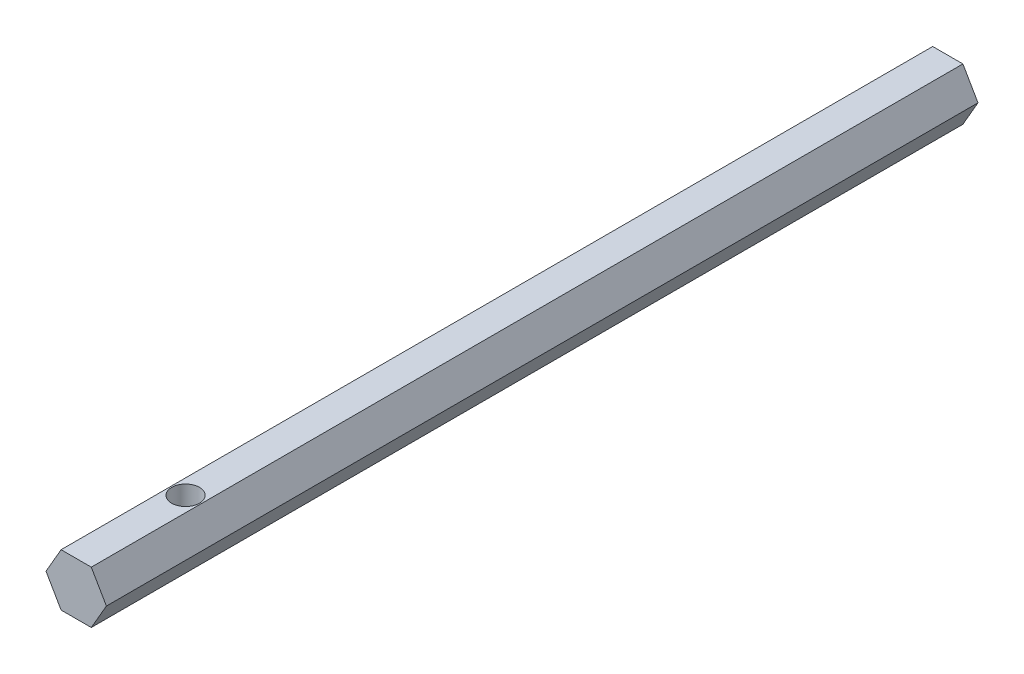
ISO-10303-21;
HEADER;
FILE_DESCRIPTION(('STEP AP214'),'2;1');
FILE_NAME('part.step','',(''),(''),'','','');
FILE_SCHEMA(('AUTOMOTIVE_DESIGN { 1 0 10303 214 1 1 1 1 }'));
ENDSEC;
DATA;
#1=APPLICATION_CONTEXT('core data for automotive mechanical design processes');
#2=APPLICATION_PROTOCOL_DEFINITION('international standard','automotive_design',2000,#1);
#3=PRODUCT_CONTEXT('',#1,'mechanical');
#4=PRODUCT('Part','Part','',(#3));
#5=PRODUCT_RELATED_PRODUCT_CATEGORY('part','',(#4));
#6=PRODUCT_DEFINITION_FORMATION('','',#4);
#7=PRODUCT_DEFINITION_CONTEXT('part definition',#1,'design');
#8=PRODUCT_DEFINITION('design','',#6,#7);
#9=PRODUCT_DEFINITION_SHAPE('','',#8);
#10=(LENGTH_UNIT() NAMED_UNIT(*) SI_UNIT(.MILLI.,.METRE.));
#11=(NAMED_UNIT(*) PLANE_ANGLE_UNIT() SI_UNIT($,.RADIAN.));
#12=(NAMED_UNIT(*) SI_UNIT($,.STERADIAN.) SOLID_ANGLE_UNIT());
#13=UNCERTAINTY_MEASURE_WITH_UNIT(LENGTH_MEASURE(1.E-05),#10,'distance_accuracy_value','');
#14=(GEOMETRIC_REPRESENTATION_CONTEXT(3) GLOBAL_UNCERTAINTY_ASSIGNED_CONTEXT((#13)) GLOBAL_UNIT_ASSIGNED_CONTEXT((#10,
#11,#12)) REPRESENTATION_CONTEXT('',''));
#15=CARTESIAN_POINT('',(0.,0.,0.));
#16=DIRECTION('',(0.,0.,1.));
#17=DIRECTION('',(1.,0.,0.));
#18=AXIS2_PLACEMENT_3D('',#15,#16,#17);
#19=CARTESIAN_POINT('',(0.866025403784438,-1.5,50.));
#20=DIRECTION('',(-0.866025403784439,0.5,0.));
#21=DIRECTION('',(-0.5,-0.866025403784439,0.));
#22=AXIS2_PLACEMENT_3D('',#19,#20,#21);
#23=PLANE('',#22);
#24=DIRECTION('',(0.5,0.866025403784439,0.));
#25=VECTOR('',#24,1.);
#26=CARTESIAN_POINT('',(0.866025403784438,-1.5,0.));
#27=LINE('',#26,#25);
#28=CARTESIAN_POINT('',(0.866025403784438,-1.5,0.));
#29=VERTEX_POINT('',#28);
#30=CARTESIAN_POINT('',(1.73205080756888,0.,0.));
#31=VERTEX_POINT('',#30);
#32=EDGE_CURVE('E125',#29,#31,#27,.T.);
#33=ORIENTED_EDGE('',*,*,#32,.T.);
#34=DIRECTION('',(0.,0.,-1.));
#35=VECTOR('',#34,1.);
#36=CARTESIAN_POINT('',(1.73205080756888,0.,50.));
#37=LINE('',#36,#35);
#38=CARTESIAN_POINT('',(1.73205080756888,0.,50.));
#39=VERTEX_POINT('',#38);
#40=EDGE_CURVE('E11',#39,#31,#37,.T.);
#41=ORIENTED_EDGE('',*,*,#40,.F.);
#42=DIRECTION('',(0.5,0.866025403784439,0.));
#43=VECTOR('',#42,1.);
#44=CARTESIAN_POINT('',(0.866025403784438,-1.5,50.));
#45=LINE('',#44,#43);
#46=CARTESIAN_POINT('',(0.866025403784438,-1.5,50.));
#47=VERTEX_POINT('',#46);
#48=EDGE_CURVE('E136',#47,#39,#45,.T.);
#49=ORIENTED_EDGE('',*,*,#48,.F.);
#50=DIRECTION('',(0.,0.,-1.));
#51=VECTOR('',#50,1.);
#52=CARTESIAN_POINT('',(0.866025403784438,-1.5,50.));
#53=LINE('',#52,#51);
#54=EDGE_CURVE('E121',#47,#29,#53,.T.);
#55=ORIENTED_EDGE('',*,*,#54,.T.);
#56=EDGE_LOOP('',(#33,#41,#49,#55));
#57=FACE_BOUND('',#56,.T.);
#58=ADVANCED_FACE('F41',(#57),#23,.F.);
#59=CARTESIAN_POINT('',(1.73205080756888,0.,50.));
#60=DIRECTION('',(-0.866025403784439,-0.5,0.));
#61=DIRECTION('',(0.5,-0.866025403784439,0.));
#62=AXIS2_PLACEMENT_3D('',#59,#60,#61);
#63=PLANE('',#62);
#64=DIRECTION('',(-0.5,0.866025403784439,0.));
#65=VECTOR('',#64,1.);
#66=CARTESIAN_POINT('',(1.73205080756888,0.,0.));
#67=LINE('',#66,#65);
#68=CARTESIAN_POINT('',(0.866025403784439,1.5,0.));
#69=VERTEX_POINT('',#68);
#70=EDGE_CURVE('E128',#31,#69,#67,.T.);
#71=ORIENTED_EDGE('',*,*,#70,.T.);
#72=DIRECTION('',(0.,0.,-1.));
#73=VECTOR('',#72,1.);
#74=CARTESIAN_POINT('',(0.866025403784439,1.5,50.));
#75=LINE('',#74,#73);
#76=CARTESIAN_POINT('',(0.866025403784439,1.5,50.));
#77=VERTEX_POINT('',#76);
#78=EDGE_CURVE('E49',#77,#69,#75,.T.);
#79=ORIENTED_EDGE('',*,*,#78,.F.);
#80=DIRECTION('',(-0.5,0.866025403784439,0.));
#81=VECTOR('',#80,1.);
#82=CARTESIAN_POINT('',(1.73205080756888,0.,50.));
#83=LINE('',#82,#81);
#84=EDGE_CURVE('E94',#39,#77,#83,.T.);
#85=ORIENTED_EDGE('',*,*,#84,.F.);
#86=ORIENTED_EDGE('',*,*,#40,.T.);
#87=EDGE_LOOP('',(#71,#79,#85,#86));
#88=FACE_BOUND('',#87,.T.);
#89=ADVANCED_FACE('F164',(#88),#63,.F.);
#90=CARTESIAN_POINT('',(0.866025403784439,1.5,50.));
#91=DIRECTION('',(0.,-1.,0.));
#92=DIRECTION('',(1.,0.,0.));
#93=AXIS2_PLACEMENT_3D('',#90,#91,#92);
#94=PLANE('',#93);
#95=CARTESIAN_POINT('',(-1.72008754483228E-13,1.5,43.7261999999998));
#96=DIRECTION('',(0.,1.,0.));
#97=DIRECTION('',(0.,0.,1.));
#98=AXIS2_PLACEMENT_3D('',#95,#96,#97);
#99=CIRCLE('',#98,0.793749999999987);
#100=CARTESIAN_POINT('',(-1.72008754483228E-13,1.5,44.5199499999998));
#101=VERTEX_POINT('',#100);
#102=EDGE_CURVE('E230',#101,#101,#99,.T.);
#103=ORIENTED_EDGE('',*,*,#102,.F.);
#104=EDGE_LOOP('',(#103));
#105=FACE_BOUND('',#104,.T.);
#106=DIRECTION('',(-1.,0.,0.));
#107=VECTOR('',#106,1.);
#108=CARTESIAN_POINT('',(0.866025403784439,1.5,0.));
#109=LINE('',#108,#107);
#110=CARTESIAN_POINT('',(-0.866025403784439,1.5,0.));
#111=VERTEX_POINT('',#110);
#112=EDGE_CURVE('E131',#69,#111,#109,.T.);
#113=ORIENTED_EDGE('',*,*,#112,.T.);
#114=DIRECTION('',(0.,0.,-1.));
#115=VECTOR('',#114,1.);
#116=CARTESIAN_POINT('',(-0.866025403784439,1.5,50.));
#117=LINE('',#116,#115);
#118=CARTESIAN_POINT('',(-0.866025403784439,1.5,50.));
#119=VERTEX_POINT('',#118);
#120=EDGE_CURVE('E116',#119,#111,#117,.T.);
#121=ORIENTED_EDGE('',*,*,#120,.F.);
#122=DIRECTION('',(-1.,0.,0.));
#123=VECTOR('',#122,1.);
#124=CARTESIAN_POINT('',(0.866025403784439,1.5,50.));
#125=LINE('',#124,#123);
#126=EDGE_CURVE('E107',#77,#119,#125,.T.);
#127=ORIENTED_EDGE('',*,*,#126,.F.);
#128=ORIENTED_EDGE('',*,*,#78,.T.);
#129=EDGE_LOOP('',(#113,#121,#127,#128));
#130=FACE_BOUND('',#129,.T.);
#131=ADVANCED_FACE('F142',(#105,#130),#94,.F.);
#132=CARTESIAN_POINT('',(-0.866025403784439,1.5,50.));
#133=DIRECTION('',(0.866025403784439,-0.5,0.));
#134=DIRECTION('',(0.5,0.866025403784439,0.));
#135=AXIS2_PLACEMENT_3D('',#132,#133,#134);
#136=PLANE('',#135);
#137=DIRECTION('',(-0.5,-0.866025403784439,0.));
#138=VECTOR('',#137,1.);
#139=CARTESIAN_POINT('',(-0.866025403784439,1.5,0.));
#140=LINE('',#139,#138);
#141=CARTESIAN_POINT('',(-1.73205080756888,0.,0.));
#142=VERTEX_POINT('',#141);
#143=EDGE_CURVE('E115',#111,#142,#140,.T.);
#144=ORIENTED_EDGE('',*,*,#143,.T.);
#145=DIRECTION('',(0.,0.,-1.));
#146=VECTOR('',#145,1.);
#147=CARTESIAN_POINT('',(-1.73205080756888,0.,50.));
#148=LINE('',#147,#146);
#149=CARTESIAN_POINT('',(-1.73205080756888,0.,50.));
#150=VERTEX_POINT('',#149);
#151=EDGE_CURVE('E112',#150,#142,#148,.T.);
#152=ORIENTED_EDGE('',*,*,#151,.F.);
#153=DIRECTION('',(-0.5,-0.866025403784439,0.));
#154=VECTOR('',#153,1.);
#155=CARTESIAN_POINT('',(-0.866025403784439,1.5,50.));
#156=LINE('',#155,#154);
#157=EDGE_CURVE('E101',#119,#150,#156,.T.);
#158=ORIENTED_EDGE('',*,*,#157,.F.);
#159=ORIENTED_EDGE('',*,*,#120,.T.);
#160=EDGE_LOOP('',(#144,#152,#158,#159));
#161=FACE_BOUND('',#160,.T.);
#162=ADVANCED_FACE('F113',(#161),#136,.F.);
#163=CARTESIAN_POINT('',(-1.73205080756888,0.,50.));
#164=DIRECTION('',(0.866025403784439,0.5,0.));
#165=DIRECTION('',(-0.5,0.866025403784439,0.));
#166=AXIS2_PLACEMENT_3D('',#163,#164,#165);
#167=PLANE('',#166);
#168=DIRECTION('',(0.5,-0.866025403784439,0.));
#169=VECTOR('',#168,1.);
#170=CARTESIAN_POINT('',(-1.73205080756888,0.,0.));
#171=LINE('',#170,#169);
#172=CARTESIAN_POINT('',(-0.866025403784439,-1.5,0.));
#173=VERTEX_POINT('',#172);
#174=EDGE_CURVE('E80',#142,#173,#171,.T.);
#175=ORIENTED_EDGE('',*,*,#174,.T.);
#176=DIRECTION('',(0.,0.,-1.));
#177=VECTOR('',#176,1.);
#178=CARTESIAN_POINT('',(-0.866025403784439,-1.5,50.));
#179=LINE('',#178,#177);
#180=CARTESIAN_POINT('',(-0.866025403784439,-1.5,50.));
#181=VERTEX_POINT('',#180);
#182=EDGE_CURVE('E117',#181,#173,#179,.T.);
#183=ORIENTED_EDGE('',*,*,#182,.F.);
#184=DIRECTION('',(0.5,-0.866025403784439,0.));
#185=VECTOR('',#184,1.);
#186=CARTESIAN_POINT('',(-1.73205080756888,0.,50.));
#187=LINE('',#186,#185);
#188=EDGE_CURVE('E105',#150,#181,#187,.T.);
#189=ORIENTED_EDGE('',*,*,#188,.F.);
#190=ORIENTED_EDGE('',*,*,#151,.T.);
#191=EDGE_LOOP('',(#175,#183,#189,#190));
#192=FACE_BOUND('',#191,.T.);
#193=ADVANCED_FACE('F119',(#192),#167,.F.);
#194=CARTESIAN_POINT('',(-0.866025403784439,-1.5,50.));
#195=DIRECTION('',(0.,1.,0.));
#196=DIRECTION('',(0.,0.,1.));
#197=AXIS2_PLACEMENT_3D('',#194,#195,#196);
#198=PLANE('',#197);
#199=CARTESIAN_POINT('',(-1.72008754483228E-13,-1.5,43.7261999999998));
#200=DIRECTION('',(0.,1.,0.));
#201=DIRECTION('',(0.,0.,1.));
#202=AXIS2_PLACEMENT_3D('',#199,#200,#201);
#203=CIRCLE('',#202,0.793749999999999);
#204=CARTESIAN_POINT('',(-1.72008754483228E-13,-1.5,44.5199499999998));
#205=VERTEX_POINT('',#204);
#206=EDGE_CURVE('E129',#205,#205,#203,.T.);
#207=ORIENTED_EDGE('',*,*,#206,.T.);
#208=EDGE_LOOP('',(#207));
#209=FACE_BOUND('',#208,.T.);
#210=DIRECTION('',(1.,0.,0.));
#211=VECTOR('',#210,1.);
#212=CARTESIAN_POINT('',(-0.866025403784439,-1.5,0.));
#213=LINE('',#212,#211);
#214=EDGE_CURVE('E86',#173,#29,#213,.T.);
#215=ORIENTED_EDGE('',*,*,#214,.T.);
#216=ORIENTED_EDGE('',*,*,#54,.F.);
#217=DIRECTION('',(1.,0.,0.));
#218=VECTOR('',#217,1.);
#219=CARTESIAN_POINT('',(-0.866025403784439,-1.5,50.));
#220=LINE('',#219,#218);
#221=EDGE_CURVE('E57',#181,#47,#220,.T.);
#222=ORIENTED_EDGE('',*,*,#221,.F.);
#223=ORIENTED_EDGE('',*,*,#182,.T.);
#224=EDGE_LOOP('',(#215,#216,#222,#223));
#225=FACE_BOUND('',#224,.T.);
#226=ADVANCED_FACE('F149',(#209,#225),#198,.F.);
#227=CARTESIAN_POINT('',(0.,0.,50.));
#228=DIRECTION('',(0.,0.,1.));
#229=DIRECTION('',(1.,0.,0.));
#230=AXIS2_PLACEMENT_3D('',#227,#228,#229);
#231=PLANE('',#230);
#232=ORIENTED_EDGE('',*,*,#48,.T.);
#233=ORIENTED_EDGE('',*,*,#84,.T.);
#234=ORIENTED_EDGE('',*,*,#126,.T.);
#235=ORIENTED_EDGE('',*,*,#157,.T.);
#236=ORIENTED_EDGE('',*,*,#188,.T.);
#237=ORIENTED_EDGE('',*,*,#221,.T.);
#238=EDGE_LOOP('',(#232,#233,#234,#235,#236,#237));
#239=FACE_BOUND('',#238,.T.);
#240=ADVANCED_FACE('F103',(#239),#231,.T.);
#241=CARTESIAN_POINT('',(0.,0.,0.));
#242=DIRECTION('',(0.,0.,1.));
#243=DIRECTION('',(1.,0.,0.));
#244=AXIS2_PLACEMENT_3D('',#241,#242,#243);
#245=PLANE('',#244);
#246=ORIENTED_EDGE('',*,*,#32,.F.);
#247=ORIENTED_EDGE('',*,*,#214,.F.);
#248=ORIENTED_EDGE('',*,*,#174,.F.);
#249=ORIENTED_EDGE('',*,*,#143,.F.);
#250=ORIENTED_EDGE('',*,*,#112,.F.);
#251=ORIENTED_EDGE('',*,*,#70,.F.);
#252=EDGE_LOOP('',(#246,#247,#248,#249,#250,#251));
#253=FACE_BOUND('',#252,.T.);
#254=ADVANCED_FACE('F145',(#253),#245,.F.);
#255=CARTESIAN_POINT('',(-1.72008754483228E-13,1.5,43.7261999999998));
#256=DIRECTION('',(0.,1.,0.));
#257=DIRECTION('',(0.,0.,1.));
#258=AXIS2_PLACEMENT_3D('',#255,#256,#257);
#259=CYLINDRICAL_SURFACE('',#258,0.793749999999993);
#260=ORIENTED_EDGE('',*,*,#206,.F.);
#261=EDGE_LOOP('',(#260));
#262=FACE_BOUND('',#261,.T.);
#263=ORIENTED_EDGE('',*,*,#102,.T.);
#264=EDGE_LOOP('',(#263));
#265=FACE_BOUND('',#264,.T.);
#266=ADVANCED_FACE('F193',(#262,#265),#259,.F.);
#267=CLOSED_SHELL('',(#58,#89,#131,#162,#193,#226,#240,#254,#266));
#268=MANIFOLD_SOLID_BREP('B2',#267);
#269=ADVANCED_BREP_SHAPE_REPRESENTATION('',(#18,#268),#14);
#270=SHAPE_DEFINITION_REPRESENTATION(#9,#269);
ENDSEC;
END-ISO-10303-21;
